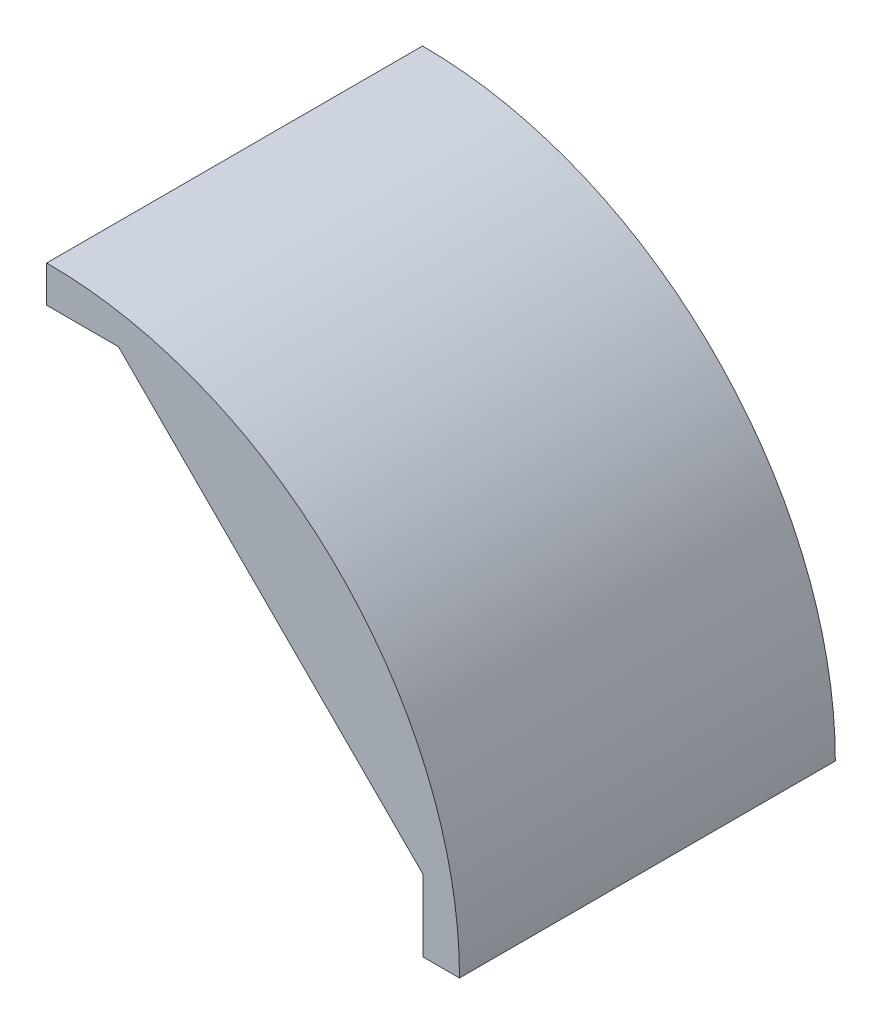
ISO-10303-21;
HEADER;
FILE_DESCRIPTION(('STEP AP214'),'2;1');
FILE_NAME('part.step','',(''),(''),'','','');
FILE_SCHEMA(('AUTOMOTIVE_DESIGN { 1 0 10303 214 1 1 1 1 }'));
ENDSEC;
DATA;
#1=APPLICATION_CONTEXT('core data for automotive mechanical design processes');
#2=APPLICATION_PROTOCOL_DEFINITION('international standard','automotive_design',2000,#1);
#3=PRODUCT_CONTEXT('',#1,'mechanical');
#4=PRODUCT('Part','Part','',(#3));
#5=PRODUCT_RELATED_PRODUCT_CATEGORY('part','',(#4));
#6=PRODUCT_DEFINITION_FORMATION('','',#4);
#7=PRODUCT_DEFINITION_CONTEXT('part definition',#1,'design');
#8=PRODUCT_DEFINITION('design','',#6,#7);
#9=PRODUCT_DEFINITION_SHAPE('','',#8);
#10=(LENGTH_UNIT() NAMED_UNIT(*) SI_UNIT(.MILLI.,.METRE.));
#11=(NAMED_UNIT(*) PLANE_ANGLE_UNIT() SI_UNIT($,.RADIAN.));
#12=(NAMED_UNIT(*) SI_UNIT($,.STERADIAN.) SOLID_ANGLE_UNIT());
#13=UNCERTAINTY_MEASURE_WITH_UNIT(LENGTH_MEASURE(1.E-05),#10,'distance_accuracy_value','');
#14=(GEOMETRIC_REPRESENTATION_CONTEXT(3) GLOBAL_UNCERTAINTY_ASSIGNED_CONTEXT((#13)) GLOBAL_UNIT_ASSIGNED_CONTEXT((#10,
#11,#12)) REPRESENTATION_CONTEXT('',''));
#15=CARTESIAN_POINT('',(0.,0.,0.));
#16=DIRECTION('',(0.,0.,1.));
#17=DIRECTION('',(1.,0.,0.));
#18=AXIS2_PLACEMENT_3D('',#15,#16,#17);
#19=CARTESIAN_POINT('',(-18.5733472300911,-18.5606444071042,78.5336205766508));
#20=DIRECTION('',(0.,0.,-1.));
#21=DIRECTION('',(-1.,0.,0.));
#22=AXIS2_PLACEMENT_3D('',#19,#20,#21);
#23=CYLINDRICAL_SURFACE('',#22,39.9000000000004);
#24=DIRECTION('',(0.,0.,-1.));
#25=VECTOR('',#24,1.);
#26=CARTESIAN_POINT('',(-18.5733472300911,21.3393555928962,78.5336205766508));
#27=LINE('',#26,#25);
#28=CARTESIAN_POINT('',(-18.5733472300912,21.3393555928962,10.38));
#29=VERTEX_POINT('',#28);
#30=CARTESIAN_POINT('',(-18.5733472300912,21.3393555928962,-10.38));
#31=VERTEX_POINT('',#30);
#32=EDGE_CURVE('E405',#29,#31,#27,.T.);
#33=ORIENTED_EDGE('',*,*,#32,.T.);
#34=CARTESIAN_POINT('',(-18.5733472300911,-18.5606444071042,-10.38));
#35=DIRECTION('',(0.,0.,-1.));
#36=DIRECTION('',(0.,1.,0.));
#37=AXIS2_PLACEMENT_3D('',#34,#35,#36);
#38=CIRCLE('',#37,39.9000000000004);
#39=CARTESIAN_POINT('',(-16.7733472300912,21.2987334104187,-10.38));
#40=VERTEX_POINT('',#39);
#41=EDGE_CURVE('E241',#31,#40,#38,.T.);
#42=ORIENTED_EDGE('',*,*,#41,.T.);
#43=DIRECTION('',(0.,0.,-1.));
#44=VECTOR('',#43,1.);
#45=CARTESIAN_POINT('',(-16.7733472300912,21.2987334104187,-10.38));
#46=LINE('',#45,#44);
#47=CARTESIAN_POINT('',(-16.7733472300912,21.2987334104187,-15.23));
#48=VERTEX_POINT('',#47);
#49=EDGE_CURVE('E403',#40,#48,#46,.T.);
#50=ORIENTED_EDGE('',*,*,#49,.T.);
#51=CARTESIAN_POINT('',(-18.5733472300912,21.3393555928962,-15.23));
#52=CARTESIAN_POINT('',(-17.6728888518386,21.3393555928962,-15.23));
#53=CARTESIAN_POINT('',(-16.7733472300912,21.2987334104187,-15.23));
#54=B_SPLINE_CURVE_WITH_KNOTS('',2,(#51,#52,#53),.UNSPECIFIED.,.F.,.F.,(3,3),(0.,1.),.UNSPECIFIED.);
#55=CARTESIAN_POINT('',(-18.5733472300912,21.3393555928962,-15.23));
#56=VERTEX_POINT('',#55);
#57=EDGE_CURVE('E407',#56,#48,#54,.T.);
#58=ORIENTED_EDGE('',*,*,#57,.F.);
#59=CARTESIAN_POINT('',(-18.5733472300911,21.3393555928962,-18.53));
#60=VERTEX_POINT('',#59);
#61=EDGE_CURVE('E576',#56,#60,#27,.T.);
#62=ORIENTED_EDGE('',*,*,#61,.T.);
#63=CARTESIAN_POINT('',(-18.5733472300911,-18.5606444071042,-18.53));
#64=DIRECTION('',(0.,0.,1.));
#65=DIRECTION('',(1.,0.,0.));
#66=AXIS2_PLACEMENT_3D('',#63,#64,#65);
#67=CIRCLE('',#66,39.9000000000004);
#68=CARTESIAN_POINT('',(21.3266527699093,-18.5606444071042,-18.53));
#69=VERTEX_POINT('',#68);
#70=EDGE_CURVE('E566',#69,#60,#67,.T.);
#71=ORIENTED_EDGE('',*,*,#70,.F.);
#72=DIRECTION('',(0.,0.,-1.));
#73=VECTOR('',#72,1.);
#74=CARTESIAN_POINT('',(21.3266527699093,-18.5606444071042,78.5336205766508));
#75=LINE('',#74,#73);
#76=CARTESIAN_POINT('',(21.3266527699093,-18.5606444071042,-15.23));
#77=VERTEX_POINT('',#76);
#78=EDGE_CURVE('E582',#77,#69,#75,.T.);
#79=ORIENTED_EDGE('',*,*,#78,.F.);
#80=CARTESIAN_POINT('',(-18.5733472300911,-18.5606444071042,-15.23));
#81=DIRECTION('',(0.,0.,1.));
#82=DIRECTION('',(1.,0.,0.));
#83=AXIS2_PLACEMENT_3D('',#80,#81,#82);
#84=CIRCLE('',#83,39.9000000000004);
#85=CARTESIAN_POINT('',(21.2860305874317,-16.7606444071044,-15.23));
#86=VERTEX_POINT('',#85);
#87=EDGE_CURVE('E503',#77,#86,#84,.T.);
#88=ORIENTED_EDGE('',*,*,#87,.T.);
#89=DIRECTION('',(0.,0.,-1.));
#90=VECTOR('',#89,1.);
#91=CARTESIAN_POINT('',(21.2860305874317,-16.7606444071042,-10.38));
#92=LINE('',#91,#90);
#93=CARTESIAN_POINT('',(21.2860305874317,-16.7606444071042,-10.38));
#94=VERTEX_POINT('',#93);
#95=EDGE_CURVE('E494',#94,#86,#92,.T.);
#96=ORIENTED_EDGE('',*,*,#95,.F.);
#97=CARTESIAN_POINT('',(21.3266527699093,-18.5606444071042,-10.38));
#98=CARTESIAN_POINT('',(21.3266527699093,-17.6601860288516,-10.38));
#99=CARTESIAN_POINT('',(21.2860305874317,-16.7606444071042,-10.38));
#100=B_SPLINE_CURVE_WITH_KNOTS('',2,(#97,#98,#99),.UNSPECIFIED.,.F.,.F.,(3,3),(0.,1.),.UNSPECIFIED.);
#101=CARTESIAN_POINT('',(21.3266527699093,-18.5606444071042,-10.38));
#102=VERTEX_POINT('',#101);
#103=EDGE_CURVE('E588',#102,#94,#100,.T.);
#104=ORIENTED_EDGE('',*,*,#103,.F.);
#105=CARTESIAN_POINT('',(21.3266527699093,-18.5606444071042,10.38));
#106=VERTEX_POINT('',#105);
#107=EDGE_CURVE('E580',#106,#102,#75,.T.);
#108=ORIENTED_EDGE('',*,*,#107,.F.);
#109=CARTESIAN_POINT('',(-18.5733472300911,-18.5606444071042,10.38));
#110=DIRECTION('',(0.,0.,1.));
#111=DIRECTION('',(1.,0.,0.));
#112=AXIS2_PLACEMENT_3D('',#109,#110,#111);
#113=CIRCLE('',#112,39.9000000000004);
#114=CARTESIAN_POINT('',(21.2860305874318,-16.7606444071046,10.38));
#115=VERTEX_POINT('',#114);
#116=EDGE_CURVE('E573',#106,#115,#113,.T.);
#117=ORIENTED_EDGE('',*,*,#116,.T.);
#118=DIRECTION('',(0.,0.,1.));
#119=VECTOR('',#118,1.);
#120=CARTESIAN_POINT('',(21.2860305874317,-16.7606444071042,10.38));
#121=LINE('',#120,#119);
#122=CARTESIAN_POINT('',(21.2860305874317,-16.7606444071042,15.23));
#123=VERTEX_POINT('',#122);
#124=EDGE_CURVE('E622',#115,#123,#121,.T.);
#125=ORIENTED_EDGE('',*,*,#124,.T.);
#126=CARTESIAN_POINT('',(21.3266527699093,-18.5606444071042,15.23));
#127=CARTESIAN_POINT('',(21.3266527699093,-17.6601860288516,15.23));
#128=CARTESIAN_POINT('',(21.2860305874317,-16.7606444071042,15.23));
#129=B_SPLINE_CURVE_WITH_KNOTS('',2,(#126,#127,#128),.UNSPECIFIED.,.F.,.F.,(3,3),(0.,1.),.UNSPECIFIED.);
#130=CARTESIAN_POINT('',(21.3266527699093,-18.5606444071042,15.23));
#131=VERTEX_POINT('',#130);
#132=EDGE_CURVE('E342',#131,#123,#129,.T.);
#133=ORIENTED_EDGE('',*,*,#132,.F.);
#134=CARTESIAN_POINT('',(21.3266527699093,-18.5606444071042,18.38));
#135=VERTEX_POINT('',#134);
#136=EDGE_CURVE('E347',#135,#131,#75,.T.);
#137=ORIENTED_EDGE('',*,*,#136,.F.);
#138=CARTESIAN_POINT('',(-18.5733472300911,-18.5606444071042,18.38));
#139=DIRECTION('',(0.,0.,1.));
#140=DIRECTION('',(1.,0.,0.));
#141=AXIS2_PLACEMENT_3D('',#138,#139,#140);
#142=CIRCLE('',#141,39.9000000000004);
#143=CARTESIAN_POINT('',(-18.5733472300911,21.3393555928962,18.38));
#144=VERTEX_POINT('',#143);
#145=EDGE_CURVE('E565',#135,#144,#142,.T.);
#146=ORIENTED_EDGE('',*,*,#145,.T.);
#147=CARTESIAN_POINT('',(-18.5733472300911,21.3393555928962,15.23));
#148=VERTEX_POINT('',#147);
#149=EDGE_CURVE('E583',#144,#148,#27,.T.);
#150=ORIENTED_EDGE('',*,*,#149,.T.);
#151=CARTESIAN_POINT('',(-18.5733472300911,-18.5606444071042,15.23));
#152=DIRECTION('',(0.,0.,-1.));
#153=DIRECTION('',(0.,1.,0.));
#154=AXIS2_PLACEMENT_3D('',#151,#152,#153);
#155=CIRCLE('',#154,39.9000000000004);
#156=CARTESIAN_POINT('',(-16.7733472300912,21.2987334104187,15.23));
#157=VERTEX_POINT('',#156);
#158=EDGE_CURVE('E45',#148,#157,#155,.T.);
#159=ORIENTED_EDGE('',*,*,#158,.T.);
#160=DIRECTION('',(0.,0.,1.));
#161=VECTOR('',#160,1.);
#162=CARTESIAN_POINT('',(-16.7733472300912,21.2987334104187,10.38));
#163=LINE('',#162,#161);
#164=CARTESIAN_POINT('',(-16.7733472300912,21.2987334104187,10.38));
#165=VERTEX_POINT('',#164);
#166=EDGE_CURVE('E698',#165,#157,#163,.T.);
#167=ORIENTED_EDGE('',*,*,#166,.F.);
#168=CARTESIAN_POINT('',(-18.5733472300912,21.3393555928962,10.38));
#169=CARTESIAN_POINT('',(-17.6728888518386,21.3393555928962,10.38));
#170=CARTESIAN_POINT('',(-16.7733472300912,21.2987334104187,10.38));
#171=B_SPLINE_CURVE_WITH_KNOTS('',2,(#168,#169,#170),.UNSPECIFIED.,.F.,.F.,(3,3),(0.,1.),.UNSPECIFIED.);
#172=EDGE_CURVE('E487',#29,#165,#171,.T.);
#173=ORIENTED_EDGE('',*,*,#172,.F.);
#174=EDGE_LOOP('',(#33,#42,#50,#58,#62,#71,#79,#88,#96,#104,#108,#117,#125,#133,#137,#146,#150,
#159,#167,#173));
#175=FACE_BOUND('',#174,.T.);
#176=ADVANCED_FACE('F18',(#175),#23,.F.);
#177=CARTESIAN_POINT('',(-20.7733472300911,20.3393555928962,20.53));
#178=DIRECTION('',(0.,1.,0.));
#179=DIRECTION('',(-1.,0.,0.));
#180=AXIS2_PLACEMENT_3D('',#177,#178,#179);
#181=PLANE('',#180);
#182=DIRECTION('',(1.,0.,0.));
#183=VECTOR('',#182,1.);
#184=CARTESIAN_POINT('',(-18.5733472300912,20.3393555928962,-10.38));
#185=LINE('',#184,#183);
#186=CARTESIAN_POINT('',(-20.0733472300912,20.3393555928962,-10.38));
#187=VERTEX_POINT('',#186);
#188=CARTESIAN_POINT('',(-18.5733472300912,20.3393555928962,-10.38));
#189=VERTEX_POINT('',#188);
#190=EDGE_CURVE('E237',#187,#189,#185,.T.);
#191=ORIENTED_EDGE('',*,*,#190,.T.);
#192=DIRECTION('',(0.,0.,-1.));
#193=VECTOR('',#192,1.);
#194=CARTESIAN_POINT('',(-18.5733472300911,20.3393555928962,78.5336205766508));
#195=LINE('',#194,#193);
#196=CARTESIAN_POINT('',(-18.5733472300912,20.3393555928962,10.38));
#197=VERTEX_POINT('',#196);
#198=EDGE_CURVE('E254',#197,#189,#195,.T.);
#199=ORIENTED_EDGE('',*,*,#198,.F.);
#200=DIRECTION('',(1.,0.,0.));
#201=VECTOR('',#200,1.);
#202=CARTESIAN_POINT('',(-18.5733472300912,20.3393555928962,10.38));
#203=LINE('',#202,#201);
#204=CARTESIAN_POINT('',(-20.0733472300912,20.3393555928962,10.38));
#205=VERTEX_POINT('',#204);
#206=EDGE_CURVE('E687',#205,#197,#203,.T.);
#207=ORIENTED_EDGE('',*,*,#206,.F.);
#208=DIRECTION('',(0.,0.,1.));
#209=VECTOR('',#208,1.);
#210=CARTESIAN_POINT('',(-20.0733472300912,20.3393555928962,10.38));
#211=LINE('',#210,#209);
#212=CARTESIAN_POINT('',(-20.0733472300912,20.3393555928962,15.23));
#213=VERTEX_POINT('',#212);
#214=EDGE_CURVE('E472',#205,#213,#211,.T.);
#215=ORIENTED_EDGE('',*,*,#214,.T.);
#216=DIRECTION('',(1.,0.,0.));
#217=VECTOR('',#216,1.);
#218=CARTESIAN_POINT('',(-18.5733472300912,20.3393555928962,15.23));
#219=LINE('',#218,#217);
#220=CARTESIAN_POINT('',(-18.5733472300912,20.3393555928962,15.23));
#221=VERTEX_POINT('',#220);
#222=EDGE_CURVE('E406',#213,#221,#219,.T.);
#223=ORIENTED_EDGE('',*,*,#222,.T.);
#224=CARTESIAN_POINT('',(-18.5733472300911,20.3393555928962,18.38));
#225=VERTEX_POINT('',#224);
#226=EDGE_CURVE('E261',#225,#221,#195,.T.);
#227=ORIENTED_EDGE('',*,*,#226,.F.);
#228=DIRECTION('',(1.,0.,0.));
#229=VECTOR('',#228,1.);
#230=CARTESIAN_POINT('',(-20.7733472300911,20.3393555928962,18.38));
#231=LINE('',#230,#229);
#232=CARTESIAN_POINT('',(-12.9319258738538,20.3393555928963,18.38));
#233=VERTEX_POINT('',#232);
#234=EDGE_CURVE('E290',#225,#233,#231,.T.);
#235=ORIENTED_EDGE('',*,*,#234,.T.);
#236=DIRECTION('',(0.,0.,-1.));
#237=VECTOR('',#236,1.);
#238=CARTESIAN_POINT('',(-12.9319258738538,20.3393555928963,20.53));
#239=LINE('',#238,#237);
#240=CARTESIAN_POINT('',(-12.9319258738538,20.3393555928963,20.53));
#241=VERTEX_POINT('',#240);
#242=EDGE_CURVE('E332',#241,#233,#239,.T.);
#243=ORIENTED_EDGE('',*,*,#242,.F.);
#244=DIRECTION('',(1.,0.,0.));
#245=VECTOR('',#244,1.);
#246=CARTESIAN_POINT('',(-20.7733472300911,20.3393555928962,20.53));
#247=LINE('',#246,#245);
#248=CARTESIAN_POINT('',(-20.7733472300911,20.3393555928962,20.53));
#249=VERTEX_POINT('',#248);
#250=EDGE_CURVE('E300',#249,#241,#247,.T.);
#251=ORIENTED_EDGE('',*,*,#250,.F.);
#252=DIRECTION('',(0.,0.,-1.));
#253=VECTOR('',#252,1.);
#254=CARTESIAN_POINT('',(-20.7733472300911,20.3393555928962,20.53));
#255=LINE('',#254,#253);
#256=CARTESIAN_POINT('',(-20.7733472300911,20.3393555928962,-20.53));
#257=VERTEX_POINT('',#256);
#258=EDGE_CURVE('E29',#249,#257,#255,.T.);
#259=ORIENTED_EDGE('',*,*,#258,.T.);
#260=DIRECTION('',(1.,0.,0.));
#261=VECTOR('',#260,1.);
#262=CARTESIAN_POINT('',(-20.7733472300911,20.3393555928962,-20.53));
#263=LINE('',#262,#261);
#264=CARTESIAN_POINT('',(-12.9319258738538,20.3393555928963,-20.53));
#265=VERTEX_POINT('',#264);
#266=EDGE_CURVE('E313',#257,#265,#263,.T.);
#267=ORIENTED_EDGE('',*,*,#266,.T.);
#268=CARTESIAN_POINT('',(-12.9319258738538,20.3393555928963,-18.53));
#269=VERTEX_POINT('',#268);
#270=EDGE_CURVE('E331',#269,#265,#239,.T.);
#271=ORIENTED_EDGE('',*,*,#270,.F.);
#272=DIRECTION('',(1.,0.,0.));
#273=VECTOR('',#272,1.);
#274=CARTESIAN_POINT('',(-20.7733472300911,20.3393555928962,-18.53));
#275=LINE('',#274,#273);
#276=CARTESIAN_POINT('',(-18.5733472300911,20.3393555928962,-18.53));
#277=VERTEX_POINT('',#276);
#278=EDGE_CURVE('E282',#277,#269,#275,.T.);
#279=ORIENTED_EDGE('',*,*,#278,.F.);
#280=CARTESIAN_POINT('',(-18.5733472300911,20.3393555928962,-15.23));
#281=VERTEX_POINT('',#280);
#282=EDGE_CURVE('E262',#281,#277,#195,.T.);
#283=ORIENTED_EDGE('',*,*,#282,.F.);
#284=DIRECTION('',(1.,0.,0.));
#285=VECTOR('',#284,1.);
#286=CARTESIAN_POINT('',(-18.5733472300912,20.3393555928962,-15.23));
#287=LINE('',#286,#285);
#288=CARTESIAN_POINT('',(-20.0733472300912,20.3393555928962,-15.23));
#289=VERTEX_POINT('',#288);
#290=EDGE_CURVE('E37',#289,#281,#287,.T.);
#291=ORIENTED_EDGE('',*,*,#290,.F.);
#292=DIRECTION('',(0.,0.,-1.));
#293=VECTOR('',#292,1.);
#294=CARTESIAN_POINT('',(-20.0733472300912,20.3393555928962,-10.38));
#295=LINE('',#294,#293);
#296=EDGE_CURVE('E255',#187,#289,#295,.T.);
#297=ORIENTED_EDGE('',*,*,#296,.F.);
#298=EDGE_LOOP('',(#191,#199,#207,#215,#223,#227,#235,#243,#251,#259,#267,#271,#279,#283,#291,#297));
#299=FACE_BOUND('',#298,.T.);
#300=ADVANCED_FACE('F252',(#299),#181,.F.);
#301=CARTESIAN_POINT('',(-18.5733472300911,-22.6606444071024,78.5336205766508));
#302=DIRECTION('',(-1.,0.,0.));
#303=DIRECTION('',(0.,0.,1.));
#304=AXIS2_PLACEMENT_3D('',#301,#302,#303);
#305=PLANE('',#304);
#306=DIRECTION('',(0.,1.,0.));
#307=VECTOR('',#306,1.);
#308=CARTESIAN_POINT('',(-18.5733472300912,20.3393555928962,-10.38));
#309=LINE('',#308,#307);
#310=EDGE_CURVE('E233',#189,#31,#309,.T.);
#311=ORIENTED_EDGE('',*,*,#310,.T.);
#312=ORIENTED_EDGE('',*,*,#32,.F.);
#313=DIRECTION('',(0.,1.,0.));
#314=VECTOR('',#313,1.);
#315=CARTESIAN_POINT('',(-18.5733472300912,20.3393555928962,10.38));
#316=LINE('',#315,#314);
#317=EDGE_CURVE('E260',#197,#29,#316,.T.);
#318=ORIENTED_EDGE('',*,*,#317,.F.);
#319=ORIENTED_EDGE('',*,*,#198,.T.);
#320=EDGE_LOOP('',(#311,#312,#318,#319));
#321=FACE_BOUND('',#320,.T.);
#322=ADVANCED_FACE('F259',(#321),#305,.F.);
#323=ORIENTED_EDGE('',*,*,#61,.F.);
#324=DIRECTION('',(0.,1.,0.));
#325=VECTOR('',#324,1.);
#326=CARTESIAN_POINT('',(-18.5733472300912,20.3393555928962,-15.23));
#327=LINE('',#326,#325);
#328=EDGE_CURVE('E426',#281,#56,#327,.T.);
#329=ORIENTED_EDGE('',*,*,#328,.F.);
#330=ORIENTED_EDGE('',*,*,#282,.T.);
#331=DIRECTION('',(0.,1.,0.));
#332=VECTOR('',#331,1.);
#333=CARTESIAN_POINT('',(-18.5733472300911,-22.6606444071024,-18.53));
#334=LINE('',#333,#332);
#335=EDGE_CURVE('E266',#277,#60,#334,.T.);
#336=ORIENTED_EDGE('',*,*,#335,.T.);
#337=EDGE_LOOP('',(#323,#329,#330,#336));
#338=FACE_BOUND('',#337,.T.);
#339=ADVANCED_FACE('F740',(#338),#305,.F.);
#340=CARTESIAN_POINT('',(20.3266527699093,-20.7606444071042,20.53));
#341=DIRECTION('',(1.,0.,0.));
#342=DIRECTION('',(0.,0.,-1.));
#343=AXIS2_PLACEMENT_3D('',#340,#341,#342);
#344=PLANE('',#343);
#345=DIRECTION('',(0.,1.,0.));
#346=VECTOR('',#345,1.);
#347=CARTESIAN_POINT('',(20.3266527699093,-18.5606444071042,-10.38));
#348=LINE('',#347,#346);
#349=CARTESIAN_POINT('',(20.3266527699093,-20.0606444071042,-10.38));
#350=VERTEX_POINT('',#349);
#351=CARTESIAN_POINT('',(20.3266527699093,-18.5606444071042,-10.38));
#352=VERTEX_POINT('',#351);
#353=EDGE_CURVE('E475',#350,#352,#348,.T.);
#354=ORIENTED_EDGE('',*,*,#353,.F.);
#355=DIRECTION('',(0.,0.,-1.));
#356=VECTOR('',#355,1.);
#357=CARTESIAN_POINT('',(20.3266527699093,-20.0606444071042,-10.38));
#358=LINE('',#357,#356);
#359=CARTESIAN_POINT('',(20.3266527699093,-20.0606444071042,-15.23));
#360=VERTEX_POINT('',#359);
#361=EDGE_CURVE('E495',#350,#360,#358,.T.);
#362=ORIENTED_EDGE('',*,*,#361,.T.);
#363=DIRECTION('',(0.,1.,0.));
#364=VECTOR('',#363,1.);
#365=CARTESIAN_POINT('',(20.3266527699093,-18.5606444071042,-15.23));
#366=LINE('',#365,#364);
#367=CARTESIAN_POINT('',(20.3266527699093,-18.5606444071042,-15.23));
#368=VERTEX_POINT('',#367);
#369=EDGE_CURVE('E483',#360,#368,#366,.T.);
#370=ORIENTED_EDGE('',*,*,#369,.T.);
#371=DIRECTION('',(0.,0.,-1.));
#372=VECTOR('',#371,1.);
#373=CARTESIAN_POINT('',(20.3266527699093,-18.5606444071042,78.5336205766508));
#374=LINE('',#373,#372);
#375=CARTESIAN_POINT('',(20.3266527699093,-18.5606444071042,-18.53));
#376=VERTEX_POINT('',#375);
#377=EDGE_CURVE('E276',#368,#376,#374,.T.);
#378=ORIENTED_EDGE('',*,*,#377,.T.);
#379=DIRECTION('',(0.,-1.,0.));
#380=VECTOR('',#379,1.);
#381=CARTESIAN_POINT('',(20.3266527699093,-20.7606444071042,-18.53));
#382=LINE('',#381,#380);
#383=CARTESIAN_POINT('',(20.3266527699093,-12.9192230508669,-18.53));
#384=VERTEX_POINT('',#383);
#385=EDGE_CURVE('E277',#384,#376,#382,.T.);
#386=ORIENTED_EDGE('',*,*,#385,.F.);
#387=DIRECTION('',(0.,0.,-1.));
#388=VECTOR('',#387,1.);
#389=CARTESIAN_POINT('',(20.3266527699093,-12.9192230508669,20.53));
#390=LINE('',#389,#388);
#391=CARTESIAN_POINT('',(20.3266527699093,-12.9192230508669,-20.53));
#392=VERTEX_POINT('',#391);
#393=EDGE_CURVE('E327',#384,#392,#390,.T.);
#394=ORIENTED_EDGE('',*,*,#393,.T.);
#395=DIRECTION('',(0.,-1.,0.));
#396=VECTOR('',#395,1.);
#397=CARTESIAN_POINT('',(20.3266527699093,-20.7606444071042,-20.53));
#398=LINE('',#397,#396);
#399=CARTESIAN_POINT('',(20.3266527699093,-20.7606444071042,-20.53));
#400=VERTEX_POINT('',#399);
#401=EDGE_CURVE('E319',#392,#400,#398,.T.);
#402=ORIENTED_EDGE('',*,*,#401,.T.);
#403=DIRECTION('',(0.,0.,-1.));
#404=VECTOR('',#403,1.);
#405=CARTESIAN_POINT('',(20.3266527699093,-20.7606444071042,20.53));
#406=LINE('',#405,#404);
#407=CARTESIAN_POINT('',(20.3266527699093,-20.7606444071042,20.53));
#408=VERTEX_POINT('',#407);
#409=EDGE_CURVE('E325',#408,#400,#406,.T.);
#410=ORIENTED_EDGE('',*,*,#409,.F.);
#411=DIRECTION('',(0.,-1.,0.));
#412=VECTOR('',#411,1.);
#413=CARTESIAN_POINT('',(20.3266527699093,-20.7606444071042,20.53));
#414=LINE('',#413,#412);
#415=CARTESIAN_POINT('',(20.3266527699093,-12.9192230508669,20.53));
#416=VERTEX_POINT('',#415);
#417=EDGE_CURVE('E304',#416,#408,#414,.T.);
#418=ORIENTED_EDGE('',*,*,#417,.F.);
#419=CARTESIAN_POINT('',(20.3266527699093,-12.9192230508669,18.38));
#420=VERTEX_POINT('',#419);
#421=EDGE_CURVE('E328',#416,#420,#390,.T.);
#422=ORIENTED_EDGE('',*,*,#421,.T.);
#423=DIRECTION('',(0.,-1.,0.));
#424=VECTOR('',#423,1.);
#425=CARTESIAN_POINT('',(20.3266527699093,-20.7606444071042,18.38));
#426=LINE('',#425,#424);
#427=CARTESIAN_POINT('',(20.3266527699093,-18.5606444071042,18.38));
#428=VERTEX_POINT('',#427);
#429=EDGE_CURVE('E284',#420,#428,#426,.T.);
#430=ORIENTED_EDGE('',*,*,#429,.T.);
#431=CARTESIAN_POINT('',(20.3266527699093,-18.5606444071042,15.23));
#432=VERTEX_POINT('',#431);
#433=EDGE_CURVE('E271',#428,#432,#374,.T.);
#434=ORIENTED_EDGE('',*,*,#433,.T.);
#435=DIRECTION('',(0.,1.,0.));
#436=VECTOR('',#435,1.);
#437=CARTESIAN_POINT('',(20.3266527699093,-18.5606444071042,15.23));
#438=LINE('',#437,#436);
#439=CARTESIAN_POINT('',(20.3266527699093,-20.0606444071042,15.23));
#440=VERTEX_POINT('',#439);
#441=EDGE_CURVE('E623',#440,#432,#438,.T.);
#442=ORIENTED_EDGE('',*,*,#441,.F.);
#443=DIRECTION('',(0.,0.,1.));
#444=VECTOR('',#443,1.);
#445=CARTESIAN_POINT('',(20.3266527699093,-20.0606444071042,10.38));
#446=LINE('',#445,#444);
#447=CARTESIAN_POINT('',(20.3266527699093,-20.0606444071042,10.38));
#448=VERTEX_POINT('',#447);
#449=EDGE_CURVE('E630',#448,#440,#446,.T.);
#450=ORIENTED_EDGE('',*,*,#449,.F.);
#451=DIRECTION('',(0.,1.,0.));
#452=VECTOR('',#451,1.);
#453=CARTESIAN_POINT('',(20.3266527699093,-18.5606444071042,10.38));
#454=LINE('',#453,#452);
#455=CARTESIAN_POINT('',(20.3266527699093,-18.5606444071042,10.38));
#456=VERTEX_POINT('',#455);
#457=EDGE_CURVE('E555',#448,#456,#454,.T.);
#458=ORIENTED_EDGE('',*,*,#457,.T.);
#459=EDGE_CURVE('E275',#456,#352,#374,.T.);
#460=ORIENTED_EDGE('',*,*,#459,.T.);
#461=EDGE_LOOP('',(#354,#362,#370,#378,#386,#394,#402,#410,#418,#422,#430,#434,#442,#450,#458,#460));
#462=FACE_BOUND('',#461,.T.);
#463=ADVANCED_FACE('F662',(#462),#344,.F.);
#464=CARTESIAN_POINT('',(-22.27334723009,-18.5606444071042,78.5336205766508));
#465=DIRECTION('',(0.,1.,0.));
#466=DIRECTION('',(0.,0.,1.));
#467=AXIS2_PLACEMENT_3D('',#464,#465,#466);
#468=PLANE('',#467);
#469=ORIENTED_EDGE('',*,*,#107,.T.);
#470=DIRECTION('',(1.,0.,0.));
#471=VECTOR('',#470,1.);
#472=CARTESIAN_POINT('',(20.3266527699093,-18.5606444071042,-10.38));
#473=LINE('',#472,#471);
#474=EDGE_CURVE('E497',#352,#102,#473,.T.);
#475=ORIENTED_EDGE('',*,*,#474,.F.);
#476=ORIENTED_EDGE('',*,*,#459,.F.);
#477=DIRECTION('',(1.,0.,0.));
#478=VECTOR('',#477,1.);
#479=CARTESIAN_POINT('',(20.3266527699093,-18.5606444071042,10.38));
#480=LINE('',#479,#478);
#481=EDGE_CURVE('E547',#456,#106,#480,.T.);
#482=ORIENTED_EDGE('',*,*,#481,.T.);
#483=EDGE_LOOP('',(#469,#475,#476,#482));
#484=FACE_BOUND('',#483,.T.);
#485=ADVANCED_FACE('F670',(#484),#468,.T.);
#486=DIRECTION('',(1.,0.,0.));
#487=VECTOR('',#486,1.);
#488=CARTESIAN_POINT('',(20.3266527699093,-18.5606444071042,-15.23));
#489=LINE('',#488,#487);
#490=EDGE_CURVE('E479',#368,#77,#489,.T.);
#491=ORIENTED_EDGE('',*,*,#490,.T.);
#492=ORIENTED_EDGE('',*,*,#78,.T.);
#493=DIRECTION('',(1.,0.,0.));
#494=VECTOR('',#493,1.);
#495=CARTESIAN_POINT('',(-22.27334723009,-18.5606444071042,-18.53));
#496=LINE('',#495,#494);
#497=EDGE_CURVE('E274',#376,#69,#496,.T.);
#498=ORIENTED_EDGE('',*,*,#497,.F.);
#499=ORIENTED_EDGE('',*,*,#377,.F.);
#500=EDGE_LOOP('',(#491,#492,#498,#499));
#501=FACE_BOUND('',#500,.T.);
#502=ADVANCED_FACE('F800',(#501),#468,.T.);
#503=CARTESIAN_POINT('',(-12.9319258738538,20.3393555928963,20.53));
#504=DIRECTION('',(0.707106781186547,0.707106781186548,0.));
#505=DIRECTION('',(-0.707106781186548,0.707106781186547,0.));
#506=AXIS2_PLACEMENT_3D('',#503,#504,#505);
#507=PLANE('',#506);
#508=DIRECTION('',(0.707106781186548,-0.707106781186547,0.));
#509=VECTOR('',#508,1.);
#510=CARTESIAN_POINT('',(-12.9319258738538,20.3393555928963,-18.53));
#511=LINE('',#510,#509);
#512=EDGE_CURVE('E280',#269,#384,#511,.T.);
#513=ORIENTED_EDGE('',*,*,#512,.F.);
#514=ORIENTED_EDGE('',*,*,#270,.T.);
#515=DIRECTION('',(0.707106781186548,-0.707106781186547,0.));
#516=VECTOR('',#515,1.);
#517=CARTESIAN_POINT('',(-12.9319258738538,20.3393555928963,-20.53));
#518=LINE('',#517,#516);
#519=EDGE_CURVE('E316',#265,#392,#518,.T.);
#520=ORIENTED_EDGE('',*,*,#519,.T.);
#521=ORIENTED_EDGE('',*,*,#393,.F.);
#522=EDGE_LOOP('',(#513,#514,#520,#521));
#523=FACE_BOUND('',#522,.T.);
#524=ADVANCED_FACE('F851',(#523),#507,.F.);
#525=CARTESIAN_POINT('',(-20.6732358712399,-20.660533048253,20.53));
#526=DIRECTION('',(0.,0.,-1.));
#527=DIRECTION('',(-1.,0.,0.));
#528=AXIS2_PLACEMENT_3D('',#525,#526,#527);
#529=CYLINDRICAL_SURFACE('',#528,45.);
#530=CARTESIAN_POINT('',(-20.6732358712399,-20.660533048253,-20.53));
#531=DIRECTION('',(0.,0.,1.));
#532=DIRECTION('',(1.,0.,0.));
#533=AXIS2_PLACEMENT_3D('',#530,#531,#532);
#534=CIRCLE('',#533,45.);
#535=CARTESIAN_POINT('',(24.3266527699093,-20.7606444071042,-20.53));
#536=VERTEX_POINT('',#535);
#537=CARTESIAN_POINT('',(-20.7733472300911,24.3393555928962,-20.53));
#538=VERTEX_POINT('',#537);
#539=EDGE_CURVE('E293',#536,#538,#534,.T.);
#540=ORIENTED_EDGE('',*,*,#539,.T.);
#541=DIRECTION('',(0.,0.,-1.));
#542=VECTOR('',#541,1.);
#543=CARTESIAN_POINT('',(-20.7733472300911,24.3393555928962,20.53));
#544=LINE('',#543,#542);
#545=CARTESIAN_POINT('',(-20.7733472300911,24.3393555928962,20.53));
#546=VERTEX_POINT('',#545);
#547=EDGE_CURVE('E11',#546,#538,#544,.T.);
#548=ORIENTED_EDGE('',*,*,#547,.F.);
#549=CARTESIAN_POINT('',(-20.6732358712399,-20.660533048253,20.53));
#550=DIRECTION('',(0.,0.,1.));
#551=DIRECTION('',(1.,0.,0.));
#552=AXIS2_PLACEMENT_3D('',#549,#550,#551);
#553=CIRCLE('',#552,45.);
#554=CARTESIAN_POINT('',(24.3266527699093,-20.7606444071042,20.53));
#555=VERTEX_POINT('',#554);
#556=EDGE_CURVE('E294',#555,#546,#553,.T.);
#557=ORIENTED_EDGE('',*,*,#556,.F.);
#558=DIRECTION('',(0.,0.,-1.));
#559=VECTOR('',#558,1.);
#560=CARTESIAN_POINT('',(24.3266527699093,-20.7606444071042,20.53));
#561=LINE('',#560,#559);
#562=EDGE_CURVE('E308',#555,#536,#561,.T.);
#563=ORIENTED_EDGE('',*,*,#562,.T.);
#564=EDGE_LOOP('',(#540,#548,#557,#563));
#565=FACE_BOUND('',#564,.T.);
#566=ADVANCED_FACE('F20',(#565),#529,.T.);
#567=CARTESIAN_POINT('',(-20.7733472300911,24.3393555928962,20.53));
#568=DIRECTION('',(1.,0.,0.));
#569=DIRECTION('',(0.,0.,-1.));
#570=AXIS2_PLACEMENT_3D('',#567,#568,#569);
#571=PLANE('',#570);
#572=DIRECTION('',(0.,-1.,0.));
#573=VECTOR('',#572,1.);
#574=CARTESIAN_POINT('',(-20.7733472300911,24.3393555928962,-20.53));
#575=LINE('',#574,#573);
#576=EDGE_CURVE('E311',#538,#257,#575,.T.);
#577=ORIENTED_EDGE('',*,*,#576,.T.);
#578=ORIENTED_EDGE('',*,*,#258,.F.);
#579=DIRECTION('',(0.,-1.,0.));
#580=VECTOR('',#579,1.);
#581=CARTESIAN_POINT('',(-20.7733472300911,24.3393555928962,20.53));
#582=LINE('',#581,#580);
#583=EDGE_CURVE('E297',#546,#249,#582,.T.);
#584=ORIENTED_EDGE('',*,*,#583,.F.);
#585=ORIENTED_EDGE('',*,*,#547,.T.);
#586=EDGE_LOOP('',(#577,#578,#584,#585));
#587=FACE_BOUND('',#586,.T.);
#588=ADVANCED_FACE('F848',(#587),#571,.F.);
#589=ORIENTED_EDGE('',*,*,#242,.T.);
#590=DIRECTION('',(0.707106781186548,-0.707106781186547,0.));
#591=VECTOR('',#590,1.);
#592=CARTESIAN_POINT('',(-12.9319258738538,20.3393555928963,18.38));
#593=LINE('',#592,#591);
#594=EDGE_CURVE('E287',#233,#420,#593,.T.);
#595=ORIENTED_EDGE('',*,*,#594,.T.);
#596=ORIENTED_EDGE('',*,*,#421,.F.);
#597=DIRECTION('',(0.707106781186548,-0.707106781186547,0.));
#598=VECTOR('',#597,1.);
#599=CARTESIAN_POINT('',(-12.9319258738538,20.3393555928963,20.53));
#600=LINE('',#599,#598);
#601=EDGE_CURVE('E302',#241,#416,#600,.T.);
#602=ORIENTED_EDGE('',*,*,#601,.F.);
#603=EDGE_LOOP('',(#589,#595,#596,#602));
#604=FACE_BOUND('',#603,.T.);
#605=ADVANCED_FACE('F840',(#604),#507,.F.);
#606=CARTESIAN_POINT('',(24.3266527699093,-20.7606444071042,20.53));
#607=DIRECTION('',(0.,1.,0.));
#608=DIRECTION('',(0.,0.,1.));
#609=AXIS2_PLACEMENT_3D('',#606,#607,#608);
#610=PLANE('',#609);
#611=DIRECTION('',(1.,0.,0.));
#612=VECTOR('',#611,1.);
#613=CARTESIAN_POINT('',(24.3266527699093,-20.7606444071042,-20.53));
#614=LINE('',#613,#612);
#615=EDGE_CURVE('E298',#400,#536,#614,.T.);
#616=ORIENTED_EDGE('',*,*,#615,.T.);
#617=ORIENTED_EDGE('',*,*,#562,.F.);
#618=DIRECTION('',(1.,0.,0.));
#619=VECTOR('',#618,1.);
#620=CARTESIAN_POINT('',(24.3266527699093,-20.7606444071042,20.53));
#621=LINE('',#620,#619);
#622=EDGE_CURVE('E306',#408,#555,#621,.T.);
#623=ORIENTED_EDGE('',*,*,#622,.F.);
#624=ORIENTED_EDGE('',*,*,#409,.T.);
#625=EDGE_LOOP('',(#616,#617,#623,#624));
#626=FACE_BOUND('',#625,.T.);
#627=ADVANCED_FACE('F832',(#626),#610,.F.);
#628=CARTESIAN_POINT('',(-20.6732358712399,-20.660533048253,20.53));
#629=DIRECTION('',(0.,0.,1.));
#630=DIRECTION('',(1.,0.,0.));
#631=AXIS2_PLACEMENT_3D('',#628,#629,#630);
#632=PLANE('',#631);
#633=ORIENTED_EDGE('',*,*,#556,.T.);
#634=ORIENTED_EDGE('',*,*,#583,.T.);
#635=ORIENTED_EDGE('',*,*,#250,.T.);
#636=ORIENTED_EDGE('',*,*,#601,.T.);
#637=ORIENTED_EDGE('',*,*,#417,.T.);
#638=ORIENTED_EDGE('',*,*,#622,.T.);
#639=EDGE_LOOP('',(#633,#634,#635,#636,#637,#638));
#640=FACE_BOUND('',#639,.T.);
#641=ADVANCED_FACE('F824',(#640),#632,.T.);
#642=CARTESIAN_POINT('',(-20.6732358712399,-20.660533048253,-20.53));
#643=DIRECTION('',(0.,0.,1.));
#644=DIRECTION('',(1.,0.,0.));
#645=AXIS2_PLACEMENT_3D('',#642,#643,#644);
#646=PLANE('',#645);
#647=ORIENTED_EDGE('',*,*,#539,.F.);
#648=ORIENTED_EDGE('',*,*,#615,.F.);
#649=ORIENTED_EDGE('',*,*,#401,.F.);
#650=ORIENTED_EDGE('',*,*,#519,.F.);
#651=ORIENTED_EDGE('',*,*,#266,.F.);
#652=ORIENTED_EDGE('',*,*,#576,.F.);
#653=EDGE_LOOP('',(#647,#648,#649,#650,#651,#652));
#654=FACE_BOUND('',#653,.T.);
#655=ADVANCED_FACE('F818',(#654),#646,.F.);
#656=CARTESIAN_POINT('',(-20.6732358712399,-20.660533048253,18.38));
#657=DIRECTION('',(0.,0.,1.));
#658=DIRECTION('',(1.,0.,0.));
#659=AXIS2_PLACEMENT_3D('',#656,#657,#658);
#660=PLANE('',#659);
#661=DIRECTION('',(0.,1.,0.));
#662=VECTOR('',#661,1.);
#663=CARTESIAN_POINT('',(-18.5733472300911,-22.6606444071024,18.38));
#664=LINE('',#663,#662);
#665=EDGE_CURVE('E265',#225,#144,#664,.T.);
#666=ORIENTED_EDGE('',*,*,#665,.T.);
#667=ORIENTED_EDGE('',*,*,#145,.F.);
#668=DIRECTION('',(1.,0.,0.));
#669=VECTOR('',#668,1.);
#670=CARTESIAN_POINT('',(-22.27334723009,-18.5606444071042,18.38));
#671=LINE('',#670,#669);
#672=EDGE_CURVE('E571',#428,#135,#671,.T.);
#673=ORIENTED_EDGE('',*,*,#672,.F.);
#674=ORIENTED_EDGE('',*,*,#429,.F.);
#675=ORIENTED_EDGE('',*,*,#594,.F.);
#676=ORIENTED_EDGE('',*,*,#234,.F.);
#677=EDGE_LOOP('',(#666,#667,#673,#674,#675,#676));
#678=FACE_BOUND('',#677,.T.);
#679=ADVANCED_FACE('F677',(#678),#660,.F.);
#680=CARTESIAN_POINT('',(-22.27334723009,-22.6606444071024,-18.53));
#681=DIRECTION('',(0.,0.,1.));
#682=DIRECTION('',(1.,0.,0.));
#683=AXIS2_PLACEMENT_3D('',#680,#681,#682);
#684=PLANE('',#683);
#685=ORIENTED_EDGE('',*,*,#278,.T.);
#686=ORIENTED_EDGE('',*,*,#512,.T.);
#687=ORIENTED_EDGE('',*,*,#385,.T.);
#688=ORIENTED_EDGE('',*,*,#497,.T.);
#689=ORIENTED_EDGE('',*,*,#70,.T.);
#690=ORIENTED_EDGE('',*,*,#335,.F.);
#691=EDGE_LOOP('',(#685,#686,#687,#688,#689,#690));
#692=FACE_BOUND('',#691,.T.);
#693=ADVANCED_FACE('F806',(#692),#684,.T.);
#694=ORIENTED_EDGE('',*,*,#226,.T.);
#695=DIRECTION('',(0.,1.,0.));
#696=VECTOR('',#695,1.);
#697=CARTESIAN_POINT('',(-18.5733472300912,20.3393555928962,15.23));
#698=LINE('',#697,#696);
#699=EDGE_CURVE('E686',#221,#148,#698,.T.);
#700=ORIENTED_EDGE('',*,*,#699,.T.);
#701=ORIENTED_EDGE('',*,*,#149,.F.);
#702=ORIENTED_EDGE('',*,*,#665,.F.);
#703=EDGE_LOOP('',(#694,#700,#701,#702));
#704=FACE_BOUND('',#703,.T.);
#705=ADVANCED_FACE('F360',(#704),#305,.F.);
#706=DIRECTION('',(1.,0.,0.));
#707=VECTOR('',#706,1.);
#708=CARTESIAN_POINT('',(20.3266527699093,-18.5606444071042,15.23));
#709=LINE('',#708,#707);
#710=EDGE_CURVE('E626',#432,#131,#709,.T.);
#711=ORIENTED_EDGE('',*,*,#710,.F.);
#712=ORIENTED_EDGE('',*,*,#433,.F.);
#713=ORIENTED_EDGE('',*,*,#672,.T.);
#714=ORIENTED_EDGE('',*,*,#136,.T.);
#715=EDGE_LOOP('',(#711,#712,#713,#714));
#716=FACE_BOUND('',#715,.T.);
#717=ADVANCED_FACE('F358',(#716),#468,.T.);
#718=CARTESIAN_POINT('',(20.3266527699093,-20.0606444071042,10.38));
#719=DIRECTION('',(0.,-1.,0.));
#720=DIRECTION('',(1.,0.,0.));
#721=AXIS2_PLACEMENT_3D('',#718,#719,#720);
#722=PLANE('',#721);
#723=DIRECTION('',(1.,0.,0.));
#724=VECTOR('',#723,1.);
#725=CARTESIAN_POINT('',(20.3266527699093,-20.0606444071042,15.23));
#726=LINE('',#725,#724);
#727=CARTESIAN_POINT('',(17.3266527699093,-20.0606444071042,15.23));
#728=VERTEX_POINT('',#727);
#729=EDGE_CURVE('E619',#728,#440,#726,.T.);
#730=ORIENTED_EDGE('',*,*,#729,.F.);
#731=DIRECTION('',(0.,0.,1.));
#732=VECTOR('',#731,1.);
#733=CARTESIAN_POINT('',(17.3266527699093,-20.0606444071042,10.38));
#734=LINE('',#733,#732);
#735=CARTESIAN_POINT('',(17.3266527699093,-20.0606444071042,10.38));
#736=VERTEX_POINT('',#735);
#737=EDGE_CURVE('E633',#736,#728,#734,.T.);
#738=ORIENTED_EDGE('',*,*,#737,.F.);
#739=DIRECTION('',(1.,0.,0.));
#740=VECTOR('',#739,1.);
#741=CARTESIAN_POINT('',(20.3266527699093,-20.0606444071042,10.38));
#742=LINE('',#741,#740);
#743=EDGE_CURVE('E560',#736,#448,#742,.T.);
#744=ORIENTED_EDGE('',*,*,#743,.T.);
#745=ORIENTED_EDGE('',*,*,#449,.T.);
#746=EDGE_LOOP('',(#730,#738,#744,#745));
#747=FACE_BOUND('',#746,.T.);
#748=ADVANCED_FACE('F658',(#747),#722,.T.);
#749=CARTESIAN_POINT('',(17.3266527699093,-20.0606444071042,10.38));
#750=DIRECTION('',(-0.64024376413914,0.768171805315026,0.));
#751=DIRECTION('',(-0.768171805315026,-0.64024376413914,0.));
#752=AXIS2_PLACEMENT_3D('',#749,#750,#751);
#753=PLANE('',#752);
#754=DIRECTION('',(-0.768171805315026,-0.64024376413914,0.));
#755=VECTOR('',#754,1.);
#756=CARTESIAN_POINT('',(17.3266527699093,-20.0606444071042,15.23));
#757=LINE('',#756,#755);
#758=EDGE_CURVE('E629',#123,#728,#757,.T.);
#759=ORIENTED_EDGE('',*,*,#758,.F.);
#760=ORIENTED_EDGE('',*,*,#124,.F.);
#761=DIRECTION('',(-0.768171805315026,-0.64024376413914,0.));
#762=VECTOR('',#761,1.);
#763=CARTESIAN_POINT('',(17.3266527699093,-20.0606444071042,10.38));
#764=LINE('',#763,#762);
#765=EDGE_CURVE('E554',#115,#736,#764,.T.);
#766=ORIENTED_EDGE('',*,*,#765,.T.);
#767=ORIENTED_EDGE('',*,*,#737,.T.);
#768=EDGE_LOOP('',(#759,#760,#766,#767));
#769=FACE_BOUND('',#768,.T.);
#770=ADVANCED_FACE('F536',(#769),#753,.T.);
#771=CARTESIAN_POINT('',(-4.47138428815494,-18.2423930115935,10.38));
#772=DIRECTION('',(0.,0.,1.));
#773=DIRECTION('',(1.,0.,0.));
#774=AXIS2_PLACEMENT_3D('',#771,#772,#773);
#775=PLANE('',#774);
#776=ORIENTED_EDGE('',*,*,#116,.F.);
#777=ORIENTED_EDGE('',*,*,#481,.F.);
#778=ORIENTED_EDGE('',*,*,#457,.F.);
#779=ORIENTED_EDGE('',*,*,#743,.F.);
#780=ORIENTED_EDGE('',*,*,#765,.F.);
#781=EDGE_LOOP('',(#776,#777,#778,#779,#780));
#782=FACE_BOUND('',#781,.T.);
#783=ADVANCED_FACE('F532',(#782),#775,.F.);
#784=CARTESIAN_POINT('',(-4.47138428815494,-18.2423930115935,15.23));
#785=DIRECTION('',(0.,0.,1.));
#786=DIRECTION('',(1.,0.,0.));
#787=AXIS2_PLACEMENT_3D('',#784,#785,#786);
#788=PLANE('',#787);
#789=ORIENTED_EDGE('',*,*,#710,.T.);
#790=ORIENTED_EDGE('',*,*,#132,.T.);
#791=ORIENTED_EDGE('',*,*,#758,.T.);
#792=ORIENTED_EDGE('',*,*,#729,.T.);
#793=ORIENTED_EDGE('',*,*,#441,.T.);
#794=EDGE_LOOP('',(#789,#790,#791,#792,#793));
#795=FACE_BOUND('',#794,.T.);
#796=ADVANCED_FACE('F527',(#795),#788,.T.);
#797=CARTESIAN_POINT('',(17.3266527699093,-20.0606444071042,-10.38));
#798=DIRECTION('',(0.64024376413914,-0.768171805315026,0.));
#799=DIRECTION('',(0.768171805315026,0.64024376413914,0.));
#800=AXIS2_PLACEMENT_3D('',#797,#798,#799);
#801=PLANE('',#800);
#802=DIRECTION('',(-0.768171805315026,-0.64024376413914,0.));
#803=VECTOR('',#802,1.);
#804=CARTESIAN_POINT('',(17.3266527699093,-20.0606444071042,-15.23));
#805=LINE('',#804,#803);
#806=CARTESIAN_POINT('',(17.3266527699093,-20.0606444071042,-15.23));
#807=VERTEX_POINT('',#806);
#808=EDGE_CURVE('E490',#86,#807,#805,.T.);
#809=ORIENTED_EDGE('',*,*,#808,.T.);
#810=DIRECTION('',(0.,0.,-1.));
#811=VECTOR('',#810,1.);
#812=CARTESIAN_POINT('',(17.3266527699093,-20.0606444071042,-10.38));
#813=LINE('',#812,#811);
#814=CARTESIAN_POINT('',(17.3266527699093,-20.0606444071042,-10.38));
#815=VERTEX_POINT('',#814);
#816=EDGE_CURVE('E491',#815,#807,#813,.T.);
#817=ORIENTED_EDGE('',*,*,#816,.F.);
#818=DIRECTION('',(-0.768171805315026,-0.64024376413914,0.));
#819=VECTOR('',#818,1.);
#820=CARTESIAN_POINT('',(17.3266527699093,-20.0606444071042,-10.38));
#821=LINE('',#820,#819);
#822=EDGE_CURVE('E482',#94,#815,#821,.T.);
#823=ORIENTED_EDGE('',*,*,#822,.F.);
#824=ORIENTED_EDGE('',*,*,#95,.T.);
#825=EDGE_LOOP('',(#809,#817,#823,#824));
#826=FACE_BOUND('',#825,.T.);
#827=ADVANCED_FACE('F523',(#826),#801,.F.);
#828=CARTESIAN_POINT('',(20.3266527699093,-20.0606444071042,-10.38));
#829=DIRECTION('',(0.,1.,0.));
#830=DIRECTION('',(-1.,0.,0.));
#831=AXIS2_PLACEMENT_3D('',#828,#829,#830);
#832=PLANE('',#831);
#833=DIRECTION('',(1.,0.,0.));
#834=VECTOR('',#833,1.);
#835=CARTESIAN_POINT('',(20.3266527699093,-20.0606444071042,-15.23));
#836=LINE('',#835,#834);
#837=EDGE_CURVE('E486',#807,#360,#836,.T.);
#838=ORIENTED_EDGE('',*,*,#837,.T.);
#839=ORIENTED_EDGE('',*,*,#361,.F.);
#840=DIRECTION('',(1.,0.,0.));
#841=VECTOR('',#840,1.);
#842=CARTESIAN_POINT('',(20.3266527699093,-20.0606444071042,-10.38));
#843=LINE('',#842,#841);
#844=EDGE_CURVE('E478',#815,#350,#843,.T.);
#845=ORIENTED_EDGE('',*,*,#844,.F.);
#846=ORIENTED_EDGE('',*,*,#816,.T.);
#847=EDGE_LOOP('',(#838,#839,#845,#846));
#848=FACE_BOUND('',#847,.T.);
#849=ADVANCED_FACE('F526',(#848),#832,.F.);
#850=CARTESIAN_POINT('',(-4.47138428815494,-18.2423930115935,-10.38));
#851=DIRECTION('',(0.,0.,-1.));
#852=DIRECTION('',(1.,0.,0.));
#853=AXIS2_PLACEMENT_3D('',#850,#851,#852);
#854=PLANE('',#853);
#855=ORIENTED_EDGE('',*,*,#103,.T.);
#856=ORIENTED_EDGE('',*,*,#822,.T.);
#857=ORIENTED_EDGE('',*,*,#844,.T.);
#858=ORIENTED_EDGE('',*,*,#353,.T.);
#859=ORIENTED_EDGE('',*,*,#474,.T.);
#860=EDGE_LOOP('',(#855,#856,#857,#858,#859));
#861=FACE_BOUND('',#860,.T.);
#862=ADVANCED_FACE('F520',(#861),#854,.F.);
#863=CARTESIAN_POINT('',(-4.47138428815494,-18.2423930115935,-15.23));
#864=DIRECTION('',(0.,0.,-1.));
#865=DIRECTION('',(1.,0.,0.));
#866=AXIS2_PLACEMENT_3D('',#863,#864,#865);
#867=PLANE('',#866);
#868=ORIENTED_EDGE('',*,*,#808,.F.);
#869=ORIENTED_EDGE('',*,*,#87,.F.);
#870=ORIENTED_EDGE('',*,*,#490,.F.);
#871=ORIENTED_EDGE('',*,*,#369,.F.);
#872=ORIENTED_EDGE('',*,*,#837,.F.);
#873=EDGE_LOOP('',(#868,#869,#870,#871,#872));
#874=FACE_BOUND('',#873,.T.);
#875=ADVANCED_FACE('F509',(#874),#867,.T.);
#876=CARTESIAN_POINT('',(-20.0733472300912,17.3393555928962,10.38));
#877=DIRECTION('',(-0.768171805315026,0.640243764139139,0.));
#878=DIRECTION('',(-0.640243764139139,-0.768171805315026,0.));
#879=AXIS2_PLACEMENT_3D('',#876,#877,#878);
#880=PLANE('',#879);
#881=DIRECTION('',(-0.640243764139139,-0.768171805315026,0.));
#882=VECTOR('',#881,1.);
#883=CARTESIAN_POINT('',(-20.0733472300912,17.3393555928962,15.23));
#884=LINE('',#883,#882);
#885=CARTESIAN_POINT('',(-20.0733472300912,17.3393555928962,15.23));
#886=VERTEX_POINT('',#885);
#887=EDGE_CURVE('E688',#157,#886,#884,.T.);
#888=ORIENTED_EDGE('',*,*,#887,.T.);
#889=DIRECTION('',(0.,0.,1.));
#890=VECTOR('',#889,1.);
#891=CARTESIAN_POINT('',(-20.0733472300912,17.3393555928962,10.38));
#892=LINE('',#891,#890);
#893=CARTESIAN_POINT('',(-20.0733472300912,17.3393555928962,10.38));
#894=VERTEX_POINT('',#893);
#895=EDGE_CURVE('E700',#894,#886,#892,.T.);
#896=ORIENTED_EDGE('',*,*,#895,.F.);
#897=DIRECTION('',(-0.640243764139139,-0.768171805315026,0.));
#898=VECTOR('',#897,1.);
#899=CARTESIAN_POINT('',(-20.0733472300912,17.3393555928962,10.38));
#900=LINE('',#899,#898);
#901=EDGE_CURVE('E461',#165,#894,#900,.T.);
#902=ORIENTED_EDGE('',*,*,#901,.F.);
#903=ORIENTED_EDGE('',*,*,#166,.T.);
#904=EDGE_LOOP('',(#888,#896,#902,#903));
#905=FACE_BOUND('',#904,.T.);
#906=ADVANCED_FACE('F519',(#905),#880,.F.);
#907=CARTESIAN_POINT('',(-20.0733472300912,20.3393555928962,10.38));
#908=DIRECTION('',(1.,0.,0.));
#909=DIRECTION('',(0.,1.,0.));
#910=AXIS2_PLACEMENT_3D('',#907,#908,#909);
#911=PLANE('',#910);
#912=DIRECTION('',(0.,1.,0.));
#913=VECTOR('',#912,1.);
#914=CARTESIAN_POINT('',(-20.0733472300912,20.3393555928962,15.23));
#915=LINE('',#914,#913);
#916=EDGE_CURVE('E409',#886,#213,#915,.T.);
#917=ORIENTED_EDGE('',*,*,#916,.T.);
#918=ORIENTED_EDGE('',*,*,#214,.F.);
#919=DIRECTION('',(0.,1.,0.));
#920=VECTOR('',#919,1.);
#921=CARTESIAN_POINT('',(-20.0733472300912,20.3393555928962,10.38));
#922=LINE('',#921,#920);
#923=EDGE_CURVE('E468',#894,#205,#922,.T.);
#924=ORIENTED_EDGE('',*,*,#923,.F.);
#925=ORIENTED_EDGE('',*,*,#895,.T.);
#926=EDGE_LOOP('',(#917,#918,#924,#925));
#927=FACE_BOUND('',#926,.T.);
#928=ADVANCED_FACE('F451',(#927),#911,.F.);
#929=CARTESIAN_POINT('',(-18.2550958345805,-4.45868146516799,10.38));
#930=DIRECTION('',(0.,0.,1.));
#931=DIRECTION('',(0.,1.,0.));
#932=AXIS2_PLACEMENT_3D('',#929,#930,#931);
#933=PLANE('',#932);
#934=ORIENTED_EDGE('',*,*,#172,.T.);
#935=ORIENTED_EDGE('',*,*,#901,.T.);
#936=ORIENTED_EDGE('',*,*,#923,.T.);
#937=ORIENTED_EDGE('',*,*,#206,.T.);
#938=ORIENTED_EDGE('',*,*,#317,.T.);
#939=EDGE_LOOP('',(#934,#935,#936,#937,#938));
#940=FACE_BOUND('',#939,.T.);
#941=ADVANCED_FACE('F447',(#940),#933,.F.);
#942=CARTESIAN_POINT('',(-18.2550958345805,-4.45868146516799,15.23));
#943=DIRECTION('',(0.,0.,1.));
#944=DIRECTION('',(0.,1.,0.));
#945=AXIS2_PLACEMENT_3D('',#942,#943,#944);
#946=PLANE('',#945);
#947=ORIENTED_EDGE('',*,*,#887,.F.);
#948=ORIENTED_EDGE('',*,*,#158,.F.);
#949=ORIENTED_EDGE('',*,*,#699,.F.);
#950=ORIENTED_EDGE('',*,*,#222,.F.);
#951=ORIENTED_EDGE('',*,*,#916,.F.);
#952=EDGE_LOOP('',(#947,#948,#949,#950,#951));
#953=FACE_BOUND('',#952,.T.);
#954=ADVANCED_FACE('F443',(#953),#946,.T.);
#955=CARTESIAN_POINT('',(-20.0733472300912,20.3393555928962,-10.38));
#956=DIRECTION('',(-1.,0.,0.));
#957=DIRECTION('',(0.,-1.,0.));
#958=AXIS2_PLACEMENT_3D('',#955,#956,#957);
#959=PLANE('',#958);
#960=DIRECTION('',(0.,1.,0.));
#961=VECTOR('',#960,1.);
#962=CARTESIAN_POINT('',(-20.0733472300912,20.3393555928962,-15.23));
#963=LINE('',#962,#961);
#964=CARTESIAN_POINT('',(-20.0733472300912,17.3393555928962,-15.23));
#965=VERTEX_POINT('',#964);
#966=EDGE_CURVE('E256',#965,#289,#963,.T.);
#967=ORIENTED_EDGE('',*,*,#966,.F.);
#968=DIRECTION('',(0.,0.,-1.));
#969=VECTOR('',#968,1.);
#970=CARTESIAN_POINT('',(-20.0733472300912,17.3393555928962,-10.38));
#971=LINE('',#970,#969);
#972=CARTESIAN_POINT('',(-20.0733472300912,17.3393555928962,-10.38));
#973=VERTEX_POINT('',#972);
#974=EDGE_CURVE('E414',#973,#965,#971,.T.);
#975=ORIENTED_EDGE('',*,*,#974,.F.);
#976=DIRECTION('',(0.,1.,0.));
#977=VECTOR('',#976,1.);
#978=CARTESIAN_POINT('',(-20.0733472300912,20.3393555928962,-10.38));
#979=LINE('',#978,#977);
#980=EDGE_CURVE('E718',#973,#187,#979,.T.);
#981=ORIENTED_EDGE('',*,*,#980,.T.);
#982=ORIENTED_EDGE('',*,*,#296,.T.);
#983=EDGE_LOOP('',(#967,#975,#981,#982));
#984=FACE_BOUND('',#983,.T.);
#985=ADVANCED_FACE('F439',(#984),#959,.T.);
#986=CARTESIAN_POINT('',(-20.0733472300912,17.3393555928962,-10.38));
#987=DIRECTION('',(0.768171805315026,-0.640243764139139,0.));
#988=DIRECTION('',(0.640243764139139,0.768171805315026,0.));
#989=AXIS2_PLACEMENT_3D('',#986,#987,#988);
#990=PLANE('',#989);
#991=DIRECTION('',(-0.640243764139139,-0.768171805315026,0.));
#992=VECTOR('',#991,1.);
#993=CARTESIAN_POINT('',(-20.0733472300912,17.3393555928962,-15.23));
#994=LINE('',#993,#992);
#995=EDGE_CURVE('E731',#48,#965,#994,.T.);
#996=ORIENTED_EDGE('',*,*,#995,.F.);
#997=ORIENTED_EDGE('',*,*,#49,.F.);
#998=DIRECTION('',(-0.640243764139139,-0.768171805315026,0.));
#999=VECTOR('',#998,1.);
#1000=CARTESIAN_POINT('',(-20.0733472300912,17.3393555928962,-10.38));
#1001=LINE('',#1000,#999);
#1002=EDGE_CURVE('E247',#40,#973,#1001,.T.);
#1003=ORIENTED_EDGE('',*,*,#1002,.T.);
#1004=ORIENTED_EDGE('',*,*,#974,.T.);
#1005=EDGE_LOOP('',(#996,#997,#1003,#1004));
#1006=FACE_BOUND('',#1005,.T.);
#1007=ADVANCED_FACE('F442',(#1006),#990,.T.);
#1008=CARTESIAN_POINT('',(-18.2550958345805,-4.45868146516799,-10.38));
#1009=DIRECTION('',(0.,0.,-1.));
#1010=DIRECTION('',(0.,1.,0.));
#1011=AXIS2_PLACEMENT_3D('',#1008,#1009,#1010);
#1012=PLANE('',#1011);
#1013=ORIENTED_EDGE('',*,*,#41,.F.);
#1014=ORIENTED_EDGE('',*,*,#310,.F.);
#1015=ORIENTED_EDGE('',*,*,#190,.F.);
#1016=ORIENTED_EDGE('',*,*,#980,.F.);
#1017=ORIENTED_EDGE('',*,*,#1002,.F.);
#1018=EDGE_LOOP('',(#1013,#1014,#1015,#1016,#1017));
#1019=FACE_BOUND('',#1018,.T.);
#1020=ADVANCED_FACE('F235',(#1019),#1012,.F.);
#1021=CARTESIAN_POINT('',(-18.2550958345805,-4.45868146516799,-15.23));
#1022=DIRECTION('',(0.,0.,-1.));
#1023=DIRECTION('',(0.,1.,0.));
#1024=AXIS2_PLACEMENT_3D('',#1021,#1022,#1023);
#1025=PLANE('',#1024);
#1026=ORIENTED_EDGE('',*,*,#328,.T.);
#1027=ORIENTED_EDGE('',*,*,#57,.T.);
#1028=ORIENTED_EDGE('',*,*,#995,.T.);
#1029=ORIENTED_EDGE('',*,*,#966,.T.);
#1030=ORIENTED_EDGE('',*,*,#290,.T.);
#1031=EDGE_LOOP('',(#1026,#1027,#1028,#1029,#1030));
#1032=FACE_BOUND('',#1031,.T.);
#1033=ADVANCED_FACE('F428',(#1032),#1025,.T.);
#1034=CLOSED_SHELL('',(#176,#300,#322,#339,#463,#485,#502,#524,#566,#588,#605,#627,#641,#655,
#679,#693,#705,#717,#748,#770,#783,#796,#827,#849,#862,#875,#906,#928,#941,#954,#985,#1007,
#1020,#1033));
#1035=MANIFOLD_SOLID_BREP('B1',#1034);
#1036=ADVANCED_BREP_SHAPE_REPRESENTATION('',(#18,#1035),#14);
#1037=SHAPE_DEFINITION_REPRESENTATION(#9,#1036);
ENDSEC;
END-ISO-10303-21;
